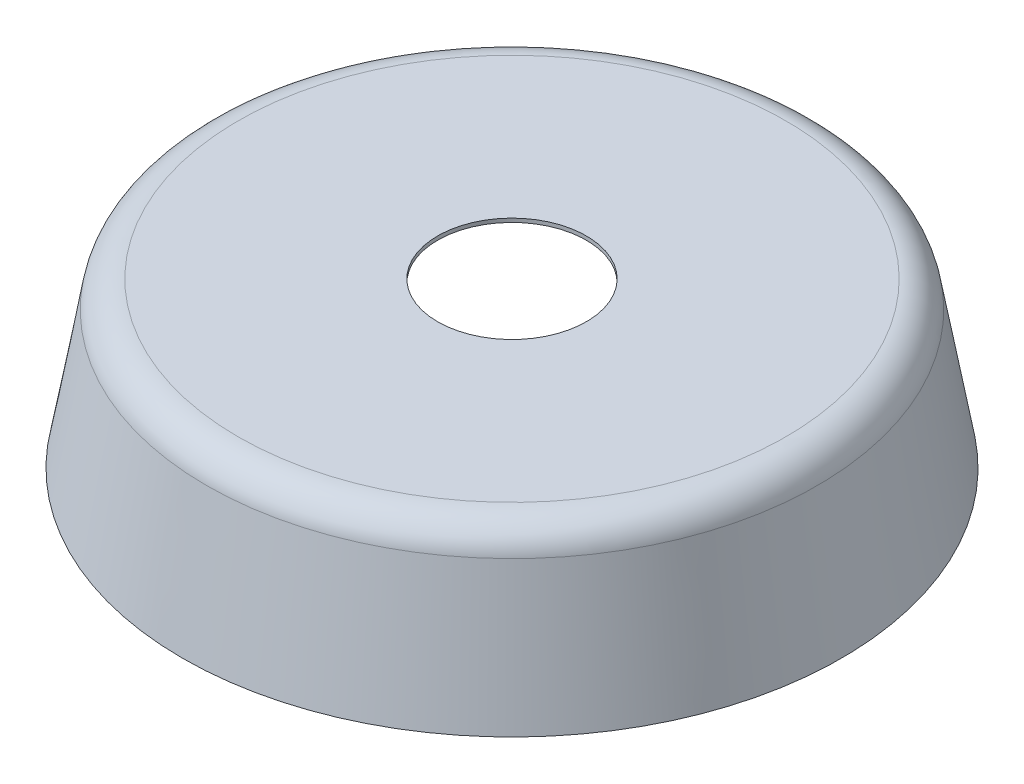
ISO-10303-21;
HEADER;
FILE_DESCRIPTION(('STEP AP214'),'2;1');
FILE_NAME('part.step','',(''),(''),'','','');
FILE_SCHEMA(('AUTOMOTIVE_DESIGN { 1 0 10303 214 1 1 1 1 }'));
ENDSEC;
DATA;
#1=APPLICATION_CONTEXT('core data for automotive mechanical design processes');
#2=APPLICATION_PROTOCOL_DEFINITION('international standard','automotive_design',2000,#1);
#3=PRODUCT_CONTEXT('',#1,'mechanical');
#4=PRODUCT('Part','Part','',(#3));
#5=PRODUCT_RELATED_PRODUCT_CATEGORY('part','',(#4));
#6=PRODUCT_DEFINITION_FORMATION('','',#4);
#7=PRODUCT_DEFINITION_CONTEXT('part definition',#1,'design');
#8=PRODUCT_DEFINITION('design','',#6,#7);
#9=PRODUCT_DEFINITION_SHAPE('','',#8);
#10=(LENGTH_UNIT() NAMED_UNIT(*) SI_UNIT(.MILLI.,.METRE.));
#11=(NAMED_UNIT(*) PLANE_ANGLE_UNIT() SI_UNIT($,.RADIAN.));
#12=(NAMED_UNIT(*) SI_UNIT($,.STERADIAN.) SOLID_ANGLE_UNIT());
#13=UNCERTAINTY_MEASURE_WITH_UNIT(LENGTH_MEASURE(1.E-05),#10,'distance_accuracy_value','');
#14=(GEOMETRIC_REPRESENTATION_CONTEXT(3) GLOBAL_UNCERTAINTY_ASSIGNED_CONTEXT((#13)) GLOBAL_UNIT_ASSIGNED_CONTEXT((#10,
#11,#12)) REPRESENTATION_CONTEXT('',''));
#15=CARTESIAN_POINT('',(0.,0.,0.));
#16=DIRECTION('',(0.,0.,1.));
#17=DIRECTION('',(1.,0.,0.));
#18=AXIS2_PLACEMENT_3D('',#15,#16,#17);
#19=CARTESIAN_POINT('',(0.,87.,0.));
#20=DIRECTION('',(0.,1.,0.));
#21=DIRECTION('',(0.,0.,1.));
#22=AXIS2_PLACEMENT_3D('',#19,#20,#21);
#23=PLANE('',#22);
#24=CARTESIAN_POINT('',(0.,87.,0.));
#25=DIRECTION('',(0.,1.,0.));
#26=DIRECTION('',(0.,0.,1.));
#27=AXIS2_PLACEMENT_3D('',#24,#25,#26);
#28=CIRCLE('',#27,39.5);
#29=CARTESIAN_POINT('',(0.,87.,39.5));
#30=VERTEX_POINT('',#29);
#31=EDGE_CURVE('E66',#30,#30,#28,.T.);
#32=ORIENTED_EDGE('',*,*,#31,.F.);
#33=EDGE_LOOP('',(#32));
#34=FACE_BOUND('',#33,.T.);
#35=CARTESIAN_POINT('',(0.,87.,0.));
#36=DIRECTION('',(0.,1.,0.));
#37=DIRECTION('',(0.,0.,1.));
#38=AXIS2_PLACEMENT_3D('',#35,#36,#37);
#39=CIRCLE('',#38,145.415285439736);
#40=CARTESIAN_POINT('',(0.,87.,145.415285439736));
#41=VERTEX_POINT('',#40);
#42=EDGE_CURVE('E44',#41,#41,#39,.T.);
#43=ORIENTED_EDGE('',*,*,#42,.T.);
#44=EDGE_LOOP('',(#43));
#45=FACE_BOUND('',#44,.T.);
#46=ADVANCED_FACE('F36',(#34,#45),#23,.T.);
#47=CARTESIAN_POINT('',(0.,0.,0.));
#48=DIRECTION('',(0.,1.,0.));
#49=DIRECTION('',(0.,0.,1.));
#50=AXIS2_PLACEMENT_3D('',#47,#48,#49);
#51=PLANE('',#50);
#52=CARTESIAN_POINT('',(0.,0.,0.));
#53=DIRECTION('',(0.,1.,0.));
#54=DIRECTION('',(0.,0.,1.));
#55=AXIS2_PLACEMENT_3D('',#52,#53,#54);
#56=CIRCLE('',#55,173.);
#57=CARTESIAN_POINT('',(0.,0.,173.));
#58=VERTEX_POINT('',#57);
#59=EDGE_CURVE('E61',#58,#58,#56,.T.);
#60=ORIENTED_EDGE('',*,*,#59,.T.);
#61=EDGE_LOOP('',(#60));
#62=FACE_BOUND('',#61,.T.);
#63=CARTESIAN_POINT('',(0.,0.,0.));
#64=DIRECTION('',(0.,1.,0.));
#65=DIRECTION('',(0.,0.,1.));
#66=AXIS2_PLACEMENT_3D('',#63,#64,#65);
#67=CIRCLE('',#66,175.030903117839);
#68=CARTESIAN_POINT('',(0.,0.,175.030903117839));
#69=VERTEX_POINT('',#68);
#70=EDGE_CURVE('E49',#69,#69,#67,.T.);
#71=ORIENTED_EDGE('',*,*,#70,.F.);
#72=EDGE_LOOP('',(#71));
#73=FACE_BOUND('',#72,.T.);
#74=ADVANCED_FACE('F87',(#62,#73),#51,.F.);
#75=CARTESIAN_POINT('',(0.,85.3475706678181,0.));
#76=DIRECTION('',(0.,-1.,0.));
#77=DIRECTION('',(0.,0.,-1.));
#78=AXIS2_PLACEMENT_3D('',#75,#76,#77);
#79=CONICAL_SURFACE('',#78,159.969567117636,0.174672199008236);
#80=CARTESIAN_POINT('',(0.,72.9543506764537,0.));
#81=DIRECTION('',(0.,-1.,0.));
#82=DIRECTION('',(0.,0.,-1.));
#83=AXIS2_PLACEMENT_3D('',#80,#81,#82);
#84=CIRCLE('',#83,162.156605939641);
#85=CARTESIAN_POINT('',(0.,72.9543506764537,-162.156605939641));
#86=VERTEX_POINT('',#85);
#87=EDGE_CURVE('E10',#86,#86,#84,.T.);
#88=ORIENTED_EDGE('',*,*,#87,.T.);
#89=EDGE_LOOP('',(#88));
#90=FACE_BOUND('',#89,.T.);
#91=ORIENTED_EDGE('',*,*,#70,.T.);
#92=EDGE_LOOP('',(#91));
#93=FACE_BOUND('',#92,.T.);
#94=ADVANCED_FACE('F93',(#90,#93),#79,.T.);
#95=CARTESIAN_POINT('',(0.,70.,0.));
#96=DIRECTION('',(0.,1.,0.));
#97=DIRECTION('',(0.,0.,1.));
#98=AXIS2_PLACEMENT_3D('',#95,#96,#97);
#99=TOROIDAL_SURFACE('',#98,145.415285439736,17.);
#100=ORIENTED_EDGE('',*,*,#87,.F.);
#101=EDGE_LOOP('',(#100));
#102=FACE_BOUND('',#101,.T.);
#103=ORIENTED_EDGE('',*,*,#42,.F.);
#104=EDGE_LOOP('',(#103));
#105=FACE_BOUND('',#104,.T.);
#106=ADVANCED_FACE('F38',(#102,#105),#99,.T.);
#107=CARTESIAN_POINT('',(0.,85.,0.));
#108=DIRECTION('',(0.,1.,0.));
#109=DIRECTION('',(0.,0.,1.));
#110=AXIS2_PLACEMENT_3D('',#107,#108,#109);
#111=PLANE('',#110);
#112=CARTESIAN_POINT('',(0.,85.,0.));
#113=DIRECTION('',(0.,1.,0.));
#114=DIRECTION('',(0.,0.,1.));
#115=AXIS2_PLACEMENT_3D('',#112,#113,#114);
#116=CIRCLE('',#115,39.5);
#117=CARTESIAN_POINT('',(0.,85.,39.5));
#118=VERTEX_POINT('',#117);
#119=EDGE_CURVE('E40',#118,#118,#116,.T.);
#120=ORIENTED_EDGE('',*,*,#119,.T.);
#121=EDGE_LOOP('',(#120));
#122=FACE_BOUND('',#121,.T.);
#123=CARTESIAN_POINT('',(0.,85.,0.));
#124=DIRECTION('',(0.,1.,0.));
#125=DIRECTION('',(0.,0.,1.));
#126=AXIS2_PLACEMENT_3D('',#123,#124,#125);
#127=CIRCLE('',#126,145.415285439736);
#128=CARTESIAN_POINT('',(0.,85.,145.415285439736));
#129=VERTEX_POINT('',#128);
#130=EDGE_CURVE('E57',#129,#129,#127,.T.);
#131=ORIENTED_EDGE('',*,*,#130,.F.);
#132=EDGE_LOOP('',(#131));
#133=FACE_BOUND('',#132,.T.);
#134=ADVANCED_FACE('F73',(#122,#133),#111,.F.);
#135=CARTESIAN_POINT('',(0.,85.,0.));
#136=DIRECTION('',(0.,-1.,0.));
#137=DIRECTION('',(0.,0.,-1.));
#138=AXIS2_PLACEMENT_3D('',#135,#136,#137);
#139=CONICAL_SURFACE('',#138,158.,0.174672199008236);
#140=CARTESIAN_POINT('',(0.,72.6067800086356,0.));
#141=DIRECTION('',(0.,1.,0.));
#142=DIRECTION('',(0.,0.,1.));
#143=AXIS2_PLACEMENT_3D('',#140,#141,#142);
#144=CIRCLE('',#143,160.187038822005);
#145=CARTESIAN_POINT('',(0.,72.6067800086356,160.187038822005));
#146=VERTEX_POINT('',#145);
#147=EDGE_CURVE('E53',#146,#146,#144,.F.);
#148=ORIENTED_EDGE('',*,*,#147,.F.);
#149=EDGE_LOOP('',(#148));
#150=FACE_BOUND('',#149,.T.);
#151=ORIENTED_EDGE('',*,*,#59,.F.);
#152=EDGE_LOOP('',(#151));
#153=FACE_BOUND('',#152,.T.);
#154=ADVANCED_FACE('F83',(#150,#153),#139,.F.);
#155=CARTESIAN_POINT('',(0.,70.,0.));
#156=DIRECTION('',(0.,1.,0.));
#157=DIRECTION('',(0.,0.,1.));
#158=AXIS2_PLACEMENT_3D('',#155,#156,#157);
#159=TOROIDAL_SURFACE('',#158,145.415285439736,15.);
#160=ORIENTED_EDGE('',*,*,#147,.T.);
#161=EDGE_LOOP('',(#160));
#162=FACE_BOUND('',#161,.T.);
#163=ORIENTED_EDGE('',*,*,#130,.T.);
#164=EDGE_LOOP('',(#163));
#165=FACE_BOUND('',#164,.T.);
#166=ADVANCED_FACE('F78',(#162,#165),#159,.F.);
#167=CARTESIAN_POINT('',(0.,77.,0.));
#168=DIRECTION('',(0.,1.,0.));
#169=DIRECTION('',(0.,0.,1.));
#170=AXIS2_PLACEMENT_3D('',#167,#168,#169);
#171=CYLINDRICAL_SURFACE('',#170,39.5);
#172=ORIENTED_EDGE('',*,*,#31,.T.);
#173=EDGE_LOOP('',(#172));
#174=FACE_BOUND('',#173,.T.);
#175=ORIENTED_EDGE('',*,*,#119,.F.);
#176=EDGE_LOOP('',(#175));
#177=FACE_BOUND('',#176,.T.);
#178=ADVANCED_FACE('F76',(#174,#177),#171,.F.);
#179=CLOSED_SHELL('',(#46,#74,#94,#106,#134,#154,#166,#178));
#180=MANIFOLD_SOLID_BREP('B2',#179);
#181=ADVANCED_BREP_SHAPE_REPRESENTATION('',(#18,#180),#14);
#182=SHAPE_DEFINITION_REPRESENTATION(#9,#181);
ENDSEC;
END-ISO-10303-21;
